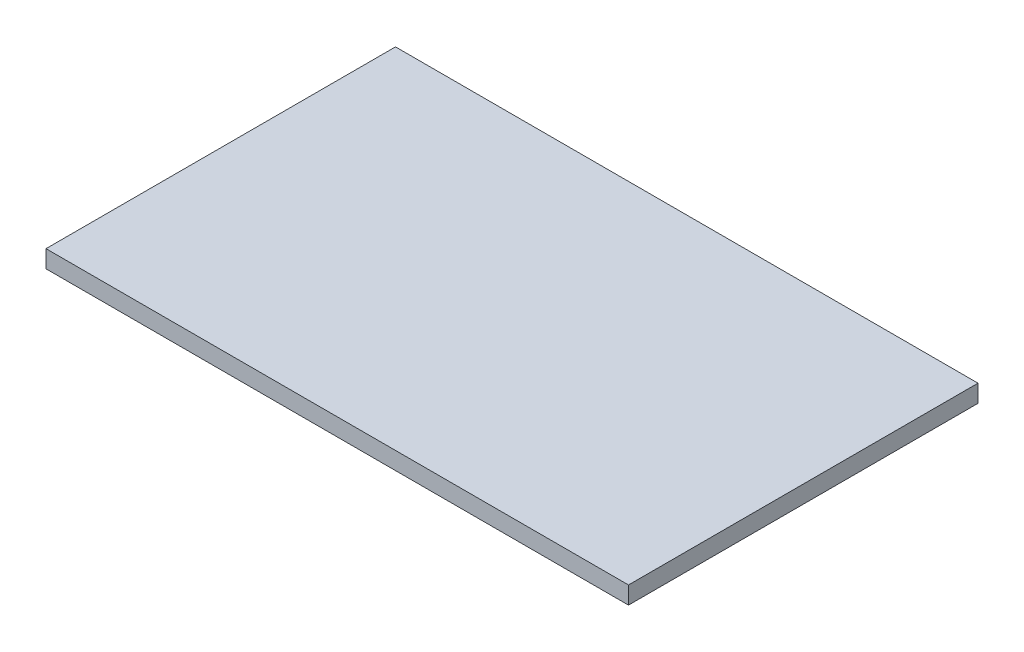
ISO-10303-21;
HEADER;
FILE_DESCRIPTION(('STEP AP214'),'2;1');
FILE_NAME('part.step','',(''),(''),'','','');
FILE_SCHEMA(('AUTOMOTIVE_DESIGN { 1 0 10303 214 1 1 1 1 }'));
ENDSEC;
DATA;
#1=APPLICATION_CONTEXT('core data for automotive mechanical design processes');
#2=APPLICATION_PROTOCOL_DEFINITION('international standard','automotive_design',2000,#1);
#3=PRODUCT_CONTEXT('',#1,'mechanical');
#4=PRODUCT('Part','Part','',(#3));
#5=PRODUCT_RELATED_PRODUCT_CATEGORY('part','',(#4));
#6=PRODUCT_DEFINITION_FORMATION('','',#4);
#7=PRODUCT_DEFINITION_CONTEXT('part definition',#1,'design');
#8=PRODUCT_DEFINITION('design','',#6,#7);
#9=PRODUCT_DEFINITION_SHAPE('','',#8);
#10=(LENGTH_UNIT() NAMED_UNIT(*) SI_UNIT(.MILLI.,.METRE.));
#11=(NAMED_UNIT(*) PLANE_ANGLE_UNIT() SI_UNIT($,.RADIAN.));
#12=(NAMED_UNIT(*) SI_UNIT($,.STERADIAN.) SOLID_ANGLE_UNIT());
#13=UNCERTAINTY_MEASURE_WITH_UNIT(LENGTH_MEASURE(1.E-05),#10,'distance_accuracy_value','');
#14=(GEOMETRIC_REPRESENTATION_CONTEXT(3) GLOBAL_UNCERTAINTY_ASSIGNED_CONTEXT((#13)) GLOBAL_UNIT_ASSIGNED_CONTEXT((#10,
#11,#12)) REPRESENTATION_CONTEXT('',''));
#15=CARTESIAN_POINT('',(0.,0.,0.));
#16=DIRECTION('',(0.,0.,1.));
#17=DIRECTION('',(1.,0.,0.));
#18=AXIS2_PLACEMENT_3D('',#15,#16,#17);
#19=CARTESIAN_POINT('',(0.,0.3,0.));
#20=DIRECTION('',(1.,0.,0.));
#21=DIRECTION('',(0.,0.,-1.));
#22=AXIS2_PLACEMENT_3D('',#19,#20,#21);
#23=PLANE('',#22);
#24=DIRECTION('',(0.,0.,1.));
#25=VECTOR('',#24,1.);
#26=CARTESIAN_POINT('',(0.,0.,0.));
#27=LINE('',#26,#25);
#28=CARTESIAN_POINT('',(0.,0.,-6.));
#29=VERTEX_POINT('',#28);
#30=CARTESIAN_POINT('',(0.,0.,0.));
#31=VERTEX_POINT('',#30);
#32=EDGE_CURVE('E96',#29,#31,#27,.T.);
#33=ORIENTED_EDGE('',*,*,#32,.T.);
#34=DIRECTION('',(0.,-1.,0.));
#35=VECTOR('',#34,1.);
#36=CARTESIAN_POINT('',(0.,0.3,0.));
#37=LINE('',#36,#35);
#38=CARTESIAN_POINT('',(0.,0.3,0.));
#39=VERTEX_POINT('',#38);
#40=EDGE_CURVE('E11',#39,#31,#37,.T.);
#41=ORIENTED_EDGE('',*,*,#40,.F.);
#42=DIRECTION('',(0.,0.,1.));
#43=VECTOR('',#42,1.);
#44=CARTESIAN_POINT('',(0.,0.3,0.));
#45=LINE('',#44,#43);
#46=CARTESIAN_POINT('',(0.,0.3,-6.));
#47=VERTEX_POINT('',#46);
#48=EDGE_CURVE('E84',#47,#39,#45,.T.);
#49=ORIENTED_EDGE('',*,*,#48,.F.);
#50=DIRECTION('',(0.,-1.,0.));
#51=VECTOR('',#50,1.);
#52=CARTESIAN_POINT('',(0.,0.3,-6.));
#53=LINE('',#52,#51);
#54=EDGE_CURVE('E92',#47,#29,#53,.T.);
#55=ORIENTED_EDGE('',*,*,#54,.T.);
#56=EDGE_LOOP('',(#33,#41,#49,#55));
#57=FACE_BOUND('',#56,.T.);
#58=ADVANCED_FACE('F33',(#57),#23,.F.);
#59=CARTESIAN_POINT('',(0.,0.3,0.));
#60=DIRECTION('',(0.,0.,-1.));
#61=DIRECTION('',(-1.,0.,0.));
#62=AXIS2_PLACEMENT_3D('',#59,#60,#61);
#63=PLANE('',#62);
#64=DIRECTION('',(1.,0.,0.));
#65=VECTOR('',#64,1.);
#66=CARTESIAN_POINT('',(0.,0.,0.));
#67=LINE('',#66,#65);
#68=CARTESIAN_POINT('',(10.,0.,0.));
#69=VERTEX_POINT('',#68);
#70=EDGE_CURVE('E88',#31,#69,#67,.T.);
#71=ORIENTED_EDGE('',*,*,#70,.T.);
#72=DIRECTION('',(0.,-1.,0.));
#73=VECTOR('',#72,1.);
#74=CARTESIAN_POINT('',(10.,0.3,0.));
#75=LINE('',#74,#73);
#76=CARTESIAN_POINT('',(10.,0.3,0.));
#77=VERTEX_POINT('',#76);
#78=EDGE_CURVE('E41',#77,#69,#75,.T.);
#79=ORIENTED_EDGE('',*,*,#78,.F.);
#80=DIRECTION('',(1.,0.,0.));
#81=VECTOR('',#80,1.);
#82=CARTESIAN_POINT('',(0.,0.3,0.));
#83=LINE('',#82,#81);
#84=EDGE_CURVE('E79',#39,#77,#83,.T.);
#85=ORIENTED_EDGE('',*,*,#84,.F.);
#86=ORIENTED_EDGE('',*,*,#40,.T.);
#87=EDGE_LOOP('',(#71,#79,#85,#86));
#88=FACE_BOUND('',#87,.T.);
#89=ADVANCED_FACE('F87',(#88),#63,.F.);
#90=CARTESIAN_POINT('',(10.,0.3,0.));
#91=DIRECTION('',(-1.,0.,0.));
#92=DIRECTION('',(0.,0.,1.));
#93=AXIS2_PLACEMENT_3D('',#90,#91,#92);
#94=PLANE('',#93);
#95=DIRECTION('',(0.,0.,-1.));
#96=VECTOR('',#95,1.);
#97=CARTESIAN_POINT('',(10.,0.,0.));
#98=LINE('',#97,#96);
#99=CARTESIAN_POINT('',(10.,0.,-6.));
#100=VERTEX_POINT('',#99);
#101=EDGE_CURVE('E66',#69,#100,#98,.T.);
#102=ORIENTED_EDGE('',*,*,#101,.T.);
#103=DIRECTION('',(0.,-1.,0.));
#104=VECTOR('',#103,1.);
#105=CARTESIAN_POINT('',(10.,0.3,-6.));
#106=LINE('',#105,#104);
#107=CARTESIAN_POINT('',(10.,0.3,-6.));
#108=VERTEX_POINT('',#107);
#109=EDGE_CURVE('E89',#108,#100,#106,.T.);
#110=ORIENTED_EDGE('',*,*,#109,.F.);
#111=DIRECTION('',(0.,0.,-1.));
#112=VECTOR('',#111,1.);
#113=CARTESIAN_POINT('',(10.,0.3,0.));
#114=LINE('',#113,#112);
#115=EDGE_CURVE('E82',#77,#108,#114,.T.);
#116=ORIENTED_EDGE('',*,*,#115,.F.);
#117=ORIENTED_EDGE('',*,*,#78,.T.);
#118=EDGE_LOOP('',(#102,#110,#116,#117));
#119=FACE_BOUND('',#118,.T.);
#120=ADVANCED_FACE('F90',(#119),#94,.F.);
#121=CARTESIAN_POINT('',(0.,0.3,-6.));
#122=DIRECTION('',(0.,0.,1.));
#123=DIRECTION('',(1.,0.,0.));
#124=AXIS2_PLACEMENT_3D('',#121,#122,#123);
#125=PLANE('',#124);
#126=DIRECTION('',(-1.,0.,0.));
#127=VECTOR('',#126,1.);
#128=CARTESIAN_POINT('',(0.,0.,-6.));
#129=LINE('',#128,#127);
#130=EDGE_CURVE('E72',#100,#29,#129,.T.);
#131=ORIENTED_EDGE('',*,*,#130,.T.);
#132=ORIENTED_EDGE('',*,*,#54,.F.);
#133=DIRECTION('',(-1.,0.,0.));
#134=VECTOR('',#133,1.);
#135=CARTESIAN_POINT('',(0.,0.3,-6.));
#136=LINE('',#135,#134);
#137=EDGE_CURVE('E49',#108,#47,#136,.T.);
#138=ORIENTED_EDGE('',*,*,#137,.F.);
#139=ORIENTED_EDGE('',*,*,#109,.T.);
#140=EDGE_LOOP('',(#131,#132,#138,#139));
#141=FACE_BOUND('',#140,.T.);
#142=ADVANCED_FACE('F103',(#141),#125,.F.);
#143=CARTESIAN_POINT('',(0.,0.3,0.));
#144=DIRECTION('',(0.,-1.,0.));
#145=DIRECTION('',(0.,0.,-1.));
#146=AXIS2_PLACEMENT_3D('',#143,#144,#145);
#147=PLANE('',#146);
#148=ORIENTED_EDGE('',*,*,#48,.T.);
#149=ORIENTED_EDGE('',*,*,#84,.T.);
#150=ORIENTED_EDGE('',*,*,#115,.T.);
#151=ORIENTED_EDGE('',*,*,#137,.T.);
#152=EDGE_LOOP('',(#148,#149,#150,#151));
#153=FACE_BOUND('',#152,.T.);
#154=ADVANCED_FACE('F80',(#153),#147,.F.);
#155=CARTESIAN_POINT('',(0.,0.,0.));
#156=DIRECTION('',(0.,-1.,0.));
#157=DIRECTION('',(0.,0.,-1.));
#158=AXIS2_PLACEMENT_3D('',#155,#156,#157);
#159=PLANE('',#158);
#160=ORIENTED_EDGE('',*,*,#32,.F.);
#161=ORIENTED_EDGE('',*,*,#130,.F.);
#162=ORIENTED_EDGE('',*,*,#101,.F.);
#163=ORIENTED_EDGE('',*,*,#70,.F.);
#164=EDGE_LOOP('',(#160,#161,#162,#163));
#165=FACE_BOUND('',#164,.T.);
#166=ADVANCED_FACE('F106',(#165),#159,.T.);
#167=CLOSED_SHELL('',(#58,#89,#120,#142,#154,#166));
#168=MANIFOLD_SOLID_BREP('B2',#167);
#169=ADVANCED_BREP_SHAPE_REPRESENTATION('',(#18,#168),#14);
#170=SHAPE_DEFINITION_REPRESENTATION(#9,#169);
ENDSEC;
END-ISO-10303-21;
